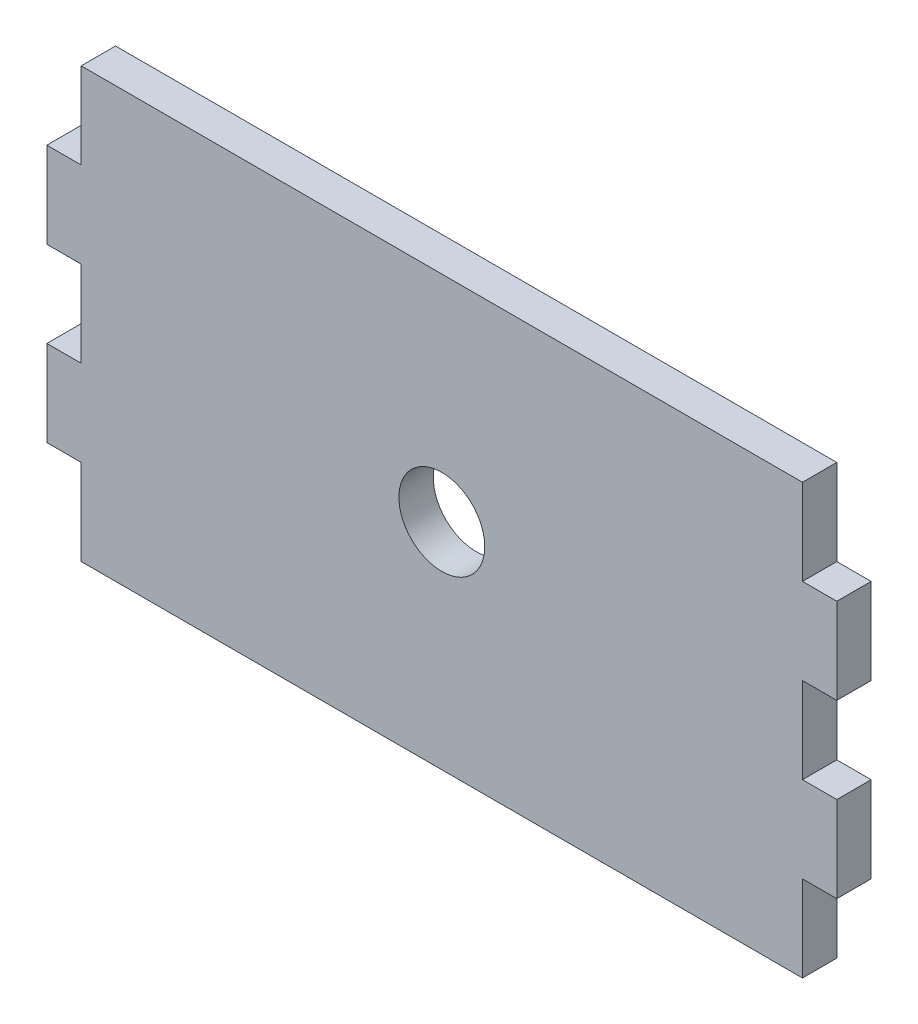
ISO-10303-21;
HEADER;
FILE_DESCRIPTION(('STEP AP214'),'2;1');
FILE_NAME('part.step','',(''),(''),'','','');
FILE_SCHEMA(('AUTOMOTIVE_DESIGN { 1 0 10303 214 1 1 1 1 }'));
ENDSEC;
DATA;
#1=APPLICATION_CONTEXT('core data for automotive mechanical design processes');
#2=APPLICATION_PROTOCOL_DEFINITION('international standard','automotive_design',2000,#1);
#3=PRODUCT_CONTEXT('',#1,'mechanical');
#4=PRODUCT('Part','Part','',(#3));
#5=PRODUCT_RELATED_PRODUCT_CATEGORY('part','',(#4));
#6=PRODUCT_DEFINITION_FORMATION('','',#4);
#7=PRODUCT_DEFINITION_CONTEXT('part definition',#1,'design');
#8=PRODUCT_DEFINITION('design','',#6,#7);
#9=PRODUCT_DEFINITION_SHAPE('','',#8);
#10=(LENGTH_UNIT() NAMED_UNIT(*) SI_UNIT(.MILLI.,.METRE.));
#11=(NAMED_UNIT(*) PLANE_ANGLE_UNIT() SI_UNIT($,.RADIAN.));
#12=(NAMED_UNIT(*) SI_UNIT($,.STERADIAN.) SOLID_ANGLE_UNIT());
#13=UNCERTAINTY_MEASURE_WITH_UNIT(LENGTH_MEASURE(1.E-05),#10,'distance_accuracy_value','');
#14=(GEOMETRIC_REPRESENTATION_CONTEXT(3) GLOBAL_UNCERTAINTY_ASSIGNED_CONTEXT((#13)) GLOBAL_UNIT_ASSIGNED_CONTEXT((#10,
#11,#12)) REPRESENTATION_CONTEXT('',''));
#15=CARTESIAN_POINT('',(0.,0.,0.));
#16=DIRECTION('',(0.,0.,1.));
#17=DIRECTION('',(1.,0.,0.));
#18=AXIS2_PLACEMENT_3D('',#15,#16,#17);
#19=CARTESIAN_POINT('',(0.,0.,4.));
#20=DIRECTION('',(0.,0.,1.));
#21=DIRECTION('',(1.,0.,0.));
#22=AXIS2_PLACEMENT_3D('',#19,#20,#21);
#23=PLANE('',#22);
#24=DIRECTION('',(0.,-1.,0.));
#25=VECTOR('',#24,1.);
#26=CARTESIAN_POINT('',(-42.,25.,4.));
#27=LINE('',#26,#25);
#28=CARTESIAN_POINT('',(-42.,25.,4.));
#29=VERTEX_POINT('',#28);
#30=CARTESIAN_POINT('',(-42.,15.,4.));
#31=VERTEX_POINT('',#30);
#32=EDGE_CURVE('E240',#29,#31,#27,.T.);
#33=ORIENTED_EDGE('',*,*,#32,.T.);
#34=DIRECTION('',(-1.,0.,0.));
#35=VECTOR('',#34,1.);
#36=CARTESIAN_POINT('',(-46.,15.,4.));
#37=LINE('',#36,#35);
#38=CARTESIAN_POINT('',(-46.,15.,4.));
#39=VERTEX_POINT('',#38);
#40=EDGE_CURVE('E128',#31,#39,#37,.T.);
#41=ORIENTED_EDGE('',*,*,#40,.T.);
#42=DIRECTION('',(0.,-1.,0.));
#43=VECTOR('',#42,1.);
#44=CARTESIAN_POINT('',(-46.,5.,4.));
#45=LINE('',#44,#43);
#46=CARTESIAN_POINT('',(-46.,5.,4.));
#47=VERTEX_POINT('',#46);
#48=EDGE_CURVE('E291',#39,#47,#45,.T.);
#49=ORIENTED_EDGE('',*,*,#48,.T.);
#50=DIRECTION('',(1.,0.,0.));
#51=VECTOR('',#50,1.);
#52=CARTESIAN_POINT('',(-46.,5.,4.));
#53=LINE('',#52,#51);
#54=CARTESIAN_POINT('',(-42.,5.,4.));
#55=VERTEX_POINT('',#54);
#56=EDGE_CURVE('E310',#47,#55,#53,.T.);
#57=ORIENTED_EDGE('',*,*,#56,.T.);
#58=DIRECTION('',(0.,-1.,0.));
#59=VECTOR('',#58,1.);
#60=CARTESIAN_POINT('',(-42.,5.,4.));
#61=LINE('',#60,#59);
#62=CARTESIAN_POINT('',(-42.,-5.,4.));
#63=VERTEX_POINT('',#62);
#64=EDGE_CURVE('E307',#55,#63,#61,.T.);
#65=ORIENTED_EDGE('',*,*,#64,.T.);
#66=DIRECTION('',(-1.,0.,0.));
#67=VECTOR('',#66,1.);
#68=CARTESIAN_POINT('',(-46.,-5.,4.));
#69=LINE('',#68,#67);
#70=CARTESIAN_POINT('',(-46.,-5.,4.));
#71=VERTEX_POINT('',#70);
#72=EDGE_CURVE('E309',#63,#71,#69,.T.);
#73=ORIENTED_EDGE('',*,*,#72,.T.);
#74=DIRECTION('',(0.,-1.,0.));
#75=VECTOR('',#74,1.);
#76=CARTESIAN_POINT('',(-46.,-15.,4.));
#77=LINE('',#76,#75);
#78=CARTESIAN_POINT('',(-46.,-15.,4.));
#79=VERTEX_POINT('',#78);
#80=EDGE_CURVE('E312',#71,#79,#77,.T.);
#81=ORIENTED_EDGE('',*,*,#80,.T.);
#82=DIRECTION('',(1.,0.,0.));
#83=VECTOR('',#82,1.);
#84=CARTESIAN_POINT('',(-46.,-15.,4.));
#85=LINE('',#84,#83);
#86=CARTESIAN_POINT('',(-42.,-15.,4.));
#87=VERTEX_POINT('',#86);
#88=EDGE_CURVE('E318',#79,#87,#85,.T.);
#89=ORIENTED_EDGE('',*,*,#88,.T.);
#90=DIRECTION('',(0.,-1.,0.));
#91=VECTOR('',#90,1.);
#92=CARTESIAN_POINT('',(-42.,-15.,4.));
#93=LINE('',#92,#91);
#94=CARTESIAN_POINT('',(-42.,-25.,4.));
#95=VERTEX_POINT('',#94);
#96=EDGE_CURVE('E320',#87,#95,#93,.T.);
#97=ORIENTED_EDGE('',*,*,#96,.T.);
#98=DIRECTION('',(1.,0.,0.));
#99=VECTOR('',#98,1.);
#100=CARTESIAN_POINT('',(-42.,-25.,4.));
#101=LINE('',#100,#99);
#102=CARTESIAN_POINT('',(42.,-25.,4.));
#103=VERTEX_POINT('',#102);
#104=EDGE_CURVE('E322',#95,#103,#101,.T.);
#105=ORIENTED_EDGE('',*,*,#104,.T.);
#106=DIRECTION('',(0.,1.,0.));
#107=VECTOR('',#106,1.);
#108=CARTESIAN_POINT('',(42.,-15.,4.));
#109=LINE('',#108,#107);
#110=CARTESIAN_POINT('',(42.,-15.,4.));
#111=VERTEX_POINT('',#110);
#112=EDGE_CURVE('E324',#103,#111,#109,.T.);
#113=ORIENTED_EDGE('',*,*,#112,.T.);
#114=DIRECTION('',(1.,0.,0.));
#115=VECTOR('',#114,1.);
#116=CARTESIAN_POINT('',(46.,-15.,4.));
#117=LINE('',#116,#115);
#118=CARTESIAN_POINT('',(46.,-15.,4.));
#119=VERTEX_POINT('',#118);
#120=EDGE_CURVE('E326',#111,#119,#117,.T.);
#121=ORIENTED_EDGE('',*,*,#120,.T.);
#122=DIRECTION('',(0.,1.,0.));
#123=VECTOR('',#122,1.);
#124=CARTESIAN_POINT('',(46.,-15.,4.));
#125=LINE('',#124,#123);
#126=CARTESIAN_POINT('',(46.,-5.00000000000001,4.));
#127=VERTEX_POINT('',#126);
#128=EDGE_CURVE('E328',#119,#127,#125,.T.);
#129=ORIENTED_EDGE('',*,*,#128,.T.);
#130=DIRECTION('',(-1.,0.,0.));
#131=VECTOR('',#130,1.);
#132=CARTESIAN_POINT('',(46.,-5.00000000000001,4.));
#133=LINE('',#132,#131);
#134=CARTESIAN_POINT('',(42.,-5.00000000000002,4.));
#135=VERTEX_POINT('',#134);
#136=EDGE_CURVE('E330',#127,#135,#133,.T.);
#137=ORIENTED_EDGE('',*,*,#136,.T.);
#138=DIRECTION('',(0.,1.,0.));
#139=VECTOR('',#138,1.);
#140=CARTESIAN_POINT('',(42.,5.00000000000002,4.));
#141=LINE('',#140,#139);
#142=CARTESIAN_POINT('',(42.,5.00000000000002,4.));
#143=VERTEX_POINT('',#142);
#144=EDGE_CURVE('E332',#135,#143,#141,.T.);
#145=ORIENTED_EDGE('',*,*,#144,.T.);
#146=DIRECTION('',(1.,0.,0.));
#147=VECTOR('',#146,1.);
#148=CARTESIAN_POINT('',(46.,5.00000000000001,4.));
#149=LINE('',#148,#147);
#150=CARTESIAN_POINT('',(46.,5.00000000000001,4.));
#151=VERTEX_POINT('',#150);
#152=EDGE_CURVE('E334',#143,#151,#149,.T.);
#153=ORIENTED_EDGE('',*,*,#152,.T.);
#154=DIRECTION('',(0.,1.,0.));
#155=VECTOR('',#154,1.);
#156=CARTESIAN_POINT('',(46.,5.00000000000001,4.));
#157=LINE('',#156,#155);
#158=CARTESIAN_POINT('',(46.,15.,4.));
#159=VERTEX_POINT('',#158);
#160=EDGE_CURVE('E183',#151,#159,#157,.T.);
#161=ORIENTED_EDGE('',*,*,#160,.T.);
#162=DIRECTION('',(-1.,0.,0.));
#163=VECTOR('',#162,1.);
#164=CARTESIAN_POINT('',(46.,15.,4.));
#165=LINE('',#164,#163);
#166=CARTESIAN_POINT('',(42.,15.,4.));
#167=VERTEX_POINT('',#166);
#168=EDGE_CURVE('E177',#159,#167,#165,.T.);
#169=ORIENTED_EDGE('',*,*,#168,.T.);
#170=DIRECTION('',(0.,1.,0.));
#171=VECTOR('',#170,1.);
#172=CARTESIAN_POINT('',(42.,25.,4.));
#173=LINE('',#172,#171);
#174=CARTESIAN_POINT('',(42.,25.,4.));
#175=VERTEX_POINT('',#174);
#176=EDGE_CURVE('E181',#167,#175,#173,.T.);
#177=ORIENTED_EDGE('',*,*,#176,.T.);
#178=DIRECTION('',(-1.,0.,0.));
#179=VECTOR('',#178,1.);
#180=CARTESIAN_POINT('',(-42.,25.,4.));
#181=LINE('',#180,#179);
#182=EDGE_CURVE('E49',#175,#29,#181,.T.);
#183=ORIENTED_EDGE('',*,*,#182,.T.);
#184=EDGE_LOOP('',(#33,#41,#49,#57,#65,#73,#81,#89,#97,#105,#113,#121,#129,#137,#145,#153,#161,
#169,#177,#183));
#185=FACE_BOUND('',#184,.T.);
#186=CARTESIAN_POINT('',(0.,0.,4.));
#187=DIRECTION('',(0.,0.,1.));
#188=DIRECTION('',(1.,0.,0.));
#189=AXIS2_PLACEMENT_3D('',#186,#187,#188);
#190=CIRCLE('',#189,5.);
#191=CARTESIAN_POINT('',(5.,0.,4.));
#192=VERTEX_POINT('',#191);
#193=EDGE_CURVE('E205',#192,#192,#190,.T.);
#194=ORIENTED_EDGE('',*,*,#193,.F.);
#195=EDGE_LOOP('',(#194));
#196=FACE_BOUND('',#195,.T.);
#197=ADVANCED_FACE('F32',(#185,#196),#23,.T.);
#198=CARTESIAN_POINT('',(0.,0.,0.));
#199=DIRECTION('',(0.,0.,1.));
#200=DIRECTION('',(1.,0.,0.));
#201=AXIS2_PLACEMENT_3D('',#198,#199,#200);
#202=PLANE('',#201);
#203=DIRECTION('',(0.,-1.,0.));
#204=VECTOR('',#203,1.);
#205=CARTESIAN_POINT('',(-42.,25.,0.));
#206=LINE('',#205,#204);
#207=CARTESIAN_POINT('',(-42.,25.,0.));
#208=VERTEX_POINT('',#207);
#209=CARTESIAN_POINT('',(-42.,15.,0.));
#210=VERTEX_POINT('',#209);
#211=EDGE_CURVE('E201',#208,#210,#206,.T.);
#212=ORIENTED_EDGE('',*,*,#211,.F.);
#213=DIRECTION('',(-1.,0.,0.));
#214=VECTOR('',#213,1.);
#215=CARTESIAN_POINT('',(-42.,25.,0.));
#216=LINE('',#215,#214);
#217=CARTESIAN_POINT('',(42.,25.,0.));
#218=VERTEX_POINT('',#217);
#219=EDGE_CURVE('E120',#218,#208,#216,.T.);
#220=ORIENTED_EDGE('',*,*,#219,.F.);
#221=DIRECTION('',(0.,1.,0.));
#222=VECTOR('',#221,1.);
#223=CARTESIAN_POINT('',(42.,25.,0.));
#224=LINE('',#223,#222);
#225=CARTESIAN_POINT('',(42.,15.,0.));
#226=VERTEX_POINT('',#225);
#227=EDGE_CURVE('E114',#226,#218,#224,.T.);
#228=ORIENTED_EDGE('',*,*,#227,.F.);
#229=DIRECTION('',(-1.,0.,0.));
#230=VECTOR('',#229,1.);
#231=CARTESIAN_POINT('',(46.,15.,0.));
#232=LINE('',#231,#230);
#233=CARTESIAN_POINT('',(46.,15.,0.));
#234=VERTEX_POINT('',#233);
#235=EDGE_CURVE('E191',#234,#226,#232,.T.);
#236=ORIENTED_EDGE('',*,*,#235,.F.);
#237=DIRECTION('',(0.,1.,0.));
#238=VECTOR('',#237,1.);
#239=CARTESIAN_POINT('',(46.,5.00000000000001,0.));
#240=LINE('',#239,#238);
#241=CARTESIAN_POINT('',(46.,5.00000000000001,0.));
#242=VERTEX_POINT('',#241);
#243=EDGE_CURVE('E235',#242,#234,#240,.T.);
#244=ORIENTED_EDGE('',*,*,#243,.F.);
#245=DIRECTION('',(1.,0.,0.));
#246=VECTOR('',#245,1.);
#247=CARTESIAN_POINT('',(46.,5.00000000000001,0.));
#248=LINE('',#247,#246);
#249=CARTESIAN_POINT('',(42.,5.00000000000002,0.));
#250=VERTEX_POINT('',#249);
#251=EDGE_CURVE('E233',#250,#242,#248,.T.);
#252=ORIENTED_EDGE('',*,*,#251,.F.);
#253=DIRECTION('',(0.,1.,0.));
#254=VECTOR('',#253,1.);
#255=CARTESIAN_POINT('',(42.,5.00000000000002,0.));
#256=LINE('',#255,#254);
#257=CARTESIAN_POINT('',(42.,-5.00000000000002,0.));
#258=VERTEX_POINT('',#257);
#259=EDGE_CURVE('E231',#258,#250,#256,.T.);
#260=ORIENTED_EDGE('',*,*,#259,.F.);
#261=DIRECTION('',(-1.,0.,0.));
#262=VECTOR('',#261,1.);
#263=CARTESIAN_POINT('',(46.,-5.00000000000001,0.));
#264=LINE('',#263,#262);
#265=CARTESIAN_POINT('',(46.,-5.00000000000001,0.));
#266=VERTEX_POINT('',#265);
#267=EDGE_CURVE('E229',#266,#258,#264,.T.);
#268=ORIENTED_EDGE('',*,*,#267,.F.);
#269=DIRECTION('',(0.,1.,0.));
#270=VECTOR('',#269,1.);
#271=CARTESIAN_POINT('',(46.,-15.,0.));
#272=LINE('',#271,#270);
#273=CARTESIAN_POINT('',(46.,-15.,0.));
#274=VERTEX_POINT('',#273);
#275=EDGE_CURVE('E227',#274,#266,#272,.T.);
#276=ORIENTED_EDGE('',*,*,#275,.F.);
#277=DIRECTION('',(1.,0.,0.));
#278=VECTOR('',#277,1.);
#279=CARTESIAN_POINT('',(46.,-15.,0.));
#280=LINE('',#279,#278);
#281=CARTESIAN_POINT('',(42.,-15.,0.));
#282=VERTEX_POINT('',#281);
#283=EDGE_CURVE('E225',#282,#274,#280,.T.);
#284=ORIENTED_EDGE('',*,*,#283,.F.);
#285=DIRECTION('',(0.,1.,0.));
#286=VECTOR('',#285,1.);
#287=CARTESIAN_POINT('',(42.,-15.,0.));
#288=LINE('',#287,#286);
#289=CARTESIAN_POINT('',(42.,-25.,0.));
#290=VERTEX_POINT('',#289);
#291=EDGE_CURVE('E223',#290,#282,#288,.T.);
#292=ORIENTED_EDGE('',*,*,#291,.F.);
#293=DIRECTION('',(1.,0.,0.));
#294=VECTOR('',#293,1.);
#295=CARTESIAN_POINT('',(-42.,-25.,0.));
#296=LINE('',#295,#294);
#297=CARTESIAN_POINT('',(-42.,-25.,0.));
#298=VERTEX_POINT('',#297);
#299=EDGE_CURVE('E221',#298,#290,#296,.T.);
#300=ORIENTED_EDGE('',*,*,#299,.F.);
#301=DIRECTION('',(0.,-1.,0.));
#302=VECTOR('',#301,1.);
#303=CARTESIAN_POINT('',(-42.,-15.,0.));
#304=LINE('',#303,#302);
#305=CARTESIAN_POINT('',(-42.,-15.,0.));
#306=VERTEX_POINT('',#305);
#307=EDGE_CURVE('E219',#306,#298,#304,.T.);
#308=ORIENTED_EDGE('',*,*,#307,.F.);
#309=DIRECTION('',(1.,0.,0.));
#310=VECTOR('',#309,1.);
#311=CARTESIAN_POINT('',(-46.,-15.,0.));
#312=LINE('',#311,#310);
#313=CARTESIAN_POINT('',(-46.,-15.,0.));
#314=VERTEX_POINT('',#313);
#315=EDGE_CURVE('E217',#314,#306,#312,.T.);
#316=ORIENTED_EDGE('',*,*,#315,.F.);
#317=DIRECTION('',(0.,-1.,0.));
#318=VECTOR('',#317,1.);
#319=CARTESIAN_POINT('',(-46.,-15.,0.));
#320=LINE('',#319,#318);
#321=CARTESIAN_POINT('',(-46.,-5.,0.));
#322=VERTEX_POINT('',#321);
#323=EDGE_CURVE('E215',#322,#314,#320,.T.);
#324=ORIENTED_EDGE('',*,*,#323,.F.);
#325=DIRECTION('',(-1.,0.,0.));
#326=VECTOR('',#325,1.);
#327=CARTESIAN_POINT('',(-46.,-5.,0.));
#328=LINE('',#327,#326);
#329=CARTESIAN_POINT('',(-42.,-5.,0.));
#330=VERTEX_POINT('',#329);
#331=EDGE_CURVE('E213',#330,#322,#328,.T.);
#332=ORIENTED_EDGE('',*,*,#331,.F.);
#333=DIRECTION('',(0.,-1.,0.));
#334=VECTOR('',#333,1.);
#335=CARTESIAN_POINT('',(-42.,5.,0.));
#336=LINE('',#335,#334);
#337=CARTESIAN_POINT('',(-42.,5.,0.));
#338=VERTEX_POINT('',#337);
#339=EDGE_CURVE('E211',#338,#330,#336,.T.);
#340=ORIENTED_EDGE('',*,*,#339,.F.);
#341=DIRECTION('',(1.,0.,0.));
#342=VECTOR('',#341,1.);
#343=CARTESIAN_POINT('',(-46.,5.,0.));
#344=LINE('',#343,#342);
#345=CARTESIAN_POINT('',(-46.,5.,0.));
#346=VERTEX_POINT('',#345);
#347=EDGE_CURVE('E209',#346,#338,#344,.T.);
#348=ORIENTED_EDGE('',*,*,#347,.F.);
#349=DIRECTION('',(0.,-1.,0.));
#350=VECTOR('',#349,1.);
#351=CARTESIAN_POINT('',(-46.,5.,0.));
#352=LINE('',#351,#350);
#353=CARTESIAN_POINT('',(-46.,15.,0.));
#354=VERTEX_POINT('',#353);
#355=EDGE_CURVE('E207',#354,#346,#352,.T.);
#356=ORIENTED_EDGE('',*,*,#355,.F.);
#357=DIRECTION('',(-1.,0.,0.));
#358=VECTOR('',#357,1.);
#359=CARTESIAN_POINT('',(-46.,15.,0.));
#360=LINE('',#359,#358);
#361=EDGE_CURVE('E204',#210,#354,#360,.T.);
#362=ORIENTED_EDGE('',*,*,#361,.F.);
#363=EDGE_LOOP('',(#212,#220,#228,#236,#244,#252,#260,#268,#276,#284,#292,#300,#308,#316,#324,
#332,#340,#348,#356,#362));
#364=FACE_BOUND('',#363,.T.);
#365=CARTESIAN_POINT('',(0.,0.,0.));
#366=DIRECTION('',(0.,0.,1.));
#367=DIRECTION('',(1.,0.,0.));
#368=AXIS2_PLACEMENT_3D('',#365,#366,#367);
#369=CIRCLE('',#368,5.);
#370=CARTESIAN_POINT('',(5.,0.,0.));
#371=VERTEX_POINT('',#370);
#372=EDGE_CURVE('E585',#371,#371,#369,.T.);
#373=ORIENTED_EDGE('',*,*,#372,.T.);
#374=EDGE_LOOP('',(#373));
#375=FACE_BOUND('',#374,.T.);
#376=ADVANCED_FACE('F295',(#364,#375),#202,.F.);
#377=CARTESIAN_POINT('',(-42.,25.,4.));
#378=DIRECTION('',(1.,0.,0.));
#379=DIRECTION('',(0.,1.,0.));
#380=AXIS2_PLACEMENT_3D('',#377,#378,#379);
#381=PLANE('',#380);
#382=ORIENTED_EDGE('',*,*,#211,.T.);
#383=DIRECTION('',(0.,0.,-1.));
#384=VECTOR('',#383,1.);
#385=CARTESIAN_POINT('',(-42.,15.,4.));
#386=LINE('',#385,#384);
#387=EDGE_CURVE('E11',#31,#210,#386,.T.);
#388=ORIENTED_EDGE('',*,*,#387,.F.);
#389=ORIENTED_EDGE('',*,*,#32,.F.);
#390=DIRECTION('',(0.,0.,-1.));
#391=VECTOR('',#390,1.);
#392=CARTESIAN_POINT('',(-42.,25.,4.));
#393=LINE('',#392,#391);
#394=EDGE_CURVE('E197',#29,#208,#393,.T.);
#395=ORIENTED_EDGE('',*,*,#394,.T.);
#396=EDGE_LOOP('',(#382,#388,#389,#395));
#397=FACE_BOUND('',#396,.T.);
#398=ADVANCED_FACE('F34',(#397),#381,.F.);
#399=CARTESIAN_POINT('',(-46.,15.,4.));
#400=DIRECTION('',(0.,-1.,0.));
#401=DIRECTION('',(1.,0.,0.));
#402=AXIS2_PLACEMENT_3D('',#399,#400,#401);
#403=PLANE('',#402);
#404=ORIENTED_EDGE('',*,*,#361,.T.);
#405=DIRECTION('',(0.,0.,-1.));
#406=VECTOR('',#405,1.);
#407=CARTESIAN_POINT('',(-46.,15.,4.));
#408=LINE('',#407,#406);
#409=EDGE_CURVE('E41',#39,#354,#408,.T.);
#410=ORIENTED_EDGE('',*,*,#409,.F.);
#411=ORIENTED_EDGE('',*,*,#40,.F.);
#412=ORIENTED_EDGE('',*,*,#387,.T.);
#413=EDGE_LOOP('',(#404,#410,#411,#412));
#414=FACE_BOUND('',#413,.T.);
#415=ADVANCED_FACE('F368',(#414),#403,.F.);
#416=CARTESIAN_POINT('',(-46.,5.,4.));
#417=DIRECTION('',(1.,0.,0.));
#418=DIRECTION('',(0.,0.,-1.));
#419=AXIS2_PLACEMENT_3D('',#416,#417,#418);
#420=PLANE('',#419);
#421=ORIENTED_EDGE('',*,*,#355,.T.);
#422=DIRECTION('',(0.,0.,-1.));
#423=VECTOR('',#422,1.);
#424=CARTESIAN_POINT('',(-46.,5.,4.));
#425=LINE('',#424,#423);
#426=EDGE_CURVE('E283',#47,#346,#425,.T.);
#427=ORIENTED_EDGE('',*,*,#426,.F.);
#428=ORIENTED_EDGE('',*,*,#48,.F.);
#429=ORIENTED_EDGE('',*,*,#409,.T.);
#430=EDGE_LOOP('',(#421,#427,#428,#429));
#431=FACE_BOUND('',#430,.T.);
#432=ADVANCED_FACE('F289',(#431),#420,.F.);
#433=CARTESIAN_POINT('',(-46.,5.,4.));
#434=DIRECTION('',(0.,1.,0.));
#435=DIRECTION('',(-1.,0.,0.));
#436=AXIS2_PLACEMENT_3D('',#433,#434,#435);
#437=PLANE('',#436);
#438=ORIENTED_EDGE('',*,*,#347,.T.);
#439=DIRECTION('',(0.,0.,-1.));
#440=VECTOR('',#439,1.);
#441=CARTESIAN_POINT('',(-42.,5.,4.));
#442=LINE('',#441,#440);
#443=EDGE_CURVE('E280',#55,#338,#442,.T.);
#444=ORIENTED_EDGE('',*,*,#443,.F.);
#445=ORIENTED_EDGE('',*,*,#56,.F.);
#446=ORIENTED_EDGE('',*,*,#426,.T.);
#447=EDGE_LOOP('',(#438,#444,#445,#446));
#448=FACE_BOUND('',#447,.T.);
#449=ADVANCED_FACE('F301',(#448),#437,.F.);
#450=CARTESIAN_POINT('',(-42.,5.,4.));
#451=DIRECTION('',(1.,0.,0.));
#452=DIRECTION('',(0.,0.,-1.));
#453=AXIS2_PLACEMENT_3D('',#450,#451,#452);
#454=PLANE('',#453);
#455=ORIENTED_EDGE('',*,*,#339,.T.);
#456=DIRECTION('',(0.,0.,-1.));
#457=VECTOR('',#456,1.);
#458=CARTESIAN_POINT('',(-42.,-5.,4.));
#459=LINE('',#458,#457);
#460=EDGE_CURVE('E277',#63,#330,#459,.T.);
#461=ORIENTED_EDGE('',*,*,#460,.F.);
#462=ORIENTED_EDGE('',*,*,#64,.F.);
#463=ORIENTED_EDGE('',*,*,#443,.T.);
#464=EDGE_LOOP('',(#455,#461,#462,#463));
#465=FACE_BOUND('',#464,.T.);
#466=ADVANCED_FACE('F305',(#465),#454,.F.);
#467=CARTESIAN_POINT('',(-46.,-5.,4.));
#468=DIRECTION('',(0.,-1.,0.));
#469=DIRECTION('',(0.,0.,-1.));
#470=AXIS2_PLACEMENT_3D('',#467,#468,#469);
#471=PLANE('',#470);
#472=ORIENTED_EDGE('',*,*,#331,.T.);
#473=DIRECTION('',(0.,0.,-1.));
#474=VECTOR('',#473,1.);
#475=CARTESIAN_POINT('',(-46.,-5.,4.));
#476=LINE('',#475,#474);
#477=EDGE_CURVE('E274',#71,#322,#476,.T.);
#478=ORIENTED_EDGE('',*,*,#477,.F.);
#479=ORIENTED_EDGE('',*,*,#72,.F.);
#480=ORIENTED_EDGE('',*,*,#460,.T.);
#481=EDGE_LOOP('',(#472,#478,#479,#480));
#482=FACE_BOUND('',#481,.T.);
#483=ADVANCED_FACE('F381',(#482),#471,.F.);
#484=CARTESIAN_POINT('',(-46.,-15.,4.));
#485=DIRECTION('',(1.,0.,0.));
#486=DIRECTION('',(0.,1.,0.));
#487=AXIS2_PLACEMENT_3D('',#484,#485,#486);
#488=PLANE('',#487);
#489=ORIENTED_EDGE('',*,*,#323,.T.);
#490=DIRECTION('',(0.,0.,-1.));
#491=VECTOR('',#490,1.);
#492=CARTESIAN_POINT('',(-46.,-15.,4.));
#493=LINE('',#492,#491);
#494=EDGE_CURVE('E271',#79,#314,#493,.T.);
#495=ORIENTED_EDGE('',*,*,#494,.F.);
#496=ORIENTED_EDGE('',*,*,#80,.F.);
#497=ORIENTED_EDGE('',*,*,#477,.T.);
#498=EDGE_LOOP('',(#489,#495,#496,#497));
#499=FACE_BOUND('',#498,.T.);
#500=ADVANCED_FACE('F384',(#499),#488,.F.);
#501=CARTESIAN_POINT('',(-46.,-15.,4.));
#502=DIRECTION('',(0.,1.,0.));
#503=DIRECTION('',(0.,0.,1.));
#504=AXIS2_PLACEMENT_3D('',#501,#502,#503);
#505=PLANE('',#504);
#506=ORIENTED_EDGE('',*,*,#315,.T.);
#507=DIRECTION('',(0.,0.,-1.));
#508=VECTOR('',#507,1.);
#509=CARTESIAN_POINT('',(-42.,-15.,4.));
#510=LINE('',#509,#508);
#511=EDGE_CURVE('E268',#87,#306,#510,.T.);
#512=ORIENTED_EDGE('',*,*,#511,.F.);
#513=ORIENTED_EDGE('',*,*,#88,.F.);
#514=ORIENTED_EDGE('',*,*,#494,.T.);
#515=EDGE_LOOP('',(#506,#512,#513,#514));
#516=FACE_BOUND('',#515,.T.);
#517=ADVANCED_FACE('F388',(#516),#505,.F.);
#518=CARTESIAN_POINT('',(-42.,-15.,4.));
#519=DIRECTION('',(1.,0.,0.));
#520=DIRECTION('',(0.,0.,-1.));
#521=AXIS2_PLACEMENT_3D('',#518,#519,#520);
#522=PLANE('',#521);
#523=ORIENTED_EDGE('',*,*,#307,.T.);
#524=DIRECTION('',(0.,0.,-1.));
#525=VECTOR('',#524,1.);
#526=CARTESIAN_POINT('',(-42.,-25.,4.));
#527=LINE('',#526,#525);
#528=EDGE_CURVE('E265',#95,#298,#527,.T.);
#529=ORIENTED_EDGE('',*,*,#528,.F.);
#530=ORIENTED_EDGE('',*,*,#96,.F.);
#531=ORIENTED_EDGE('',*,*,#511,.T.);
#532=EDGE_LOOP('',(#523,#529,#530,#531));
#533=FACE_BOUND('',#532,.T.);
#534=ADVANCED_FACE('F392',(#533),#522,.F.);
#535=CARTESIAN_POINT('',(-42.,-25.,4.));
#536=DIRECTION('',(0.,1.,0.));
#537=DIRECTION('',(-1.,0.,0.));
#538=AXIS2_PLACEMENT_3D('',#535,#536,#537);
#539=PLANE('',#538);
#540=ORIENTED_EDGE('',*,*,#299,.T.);
#541=DIRECTION('',(0.,0.,-1.));
#542=VECTOR('',#541,1.);
#543=CARTESIAN_POINT('',(42.,-25.,4.));
#544=LINE('',#543,#542);
#545=EDGE_CURVE('E262',#103,#290,#544,.T.);
#546=ORIENTED_EDGE('',*,*,#545,.F.);
#547=ORIENTED_EDGE('',*,*,#104,.F.);
#548=ORIENTED_EDGE('',*,*,#528,.T.);
#549=EDGE_LOOP('',(#540,#546,#547,#548));
#550=FACE_BOUND('',#549,.T.);
#551=ADVANCED_FACE('F396',(#550),#539,.F.);
#552=CARTESIAN_POINT('',(42.,-15.,4.));
#553=DIRECTION('',(-1.,0.,0.));
#554=DIRECTION('',(0.,-1.,0.));
#555=AXIS2_PLACEMENT_3D('',#552,#553,#554);
#556=PLANE('',#555);
#557=ORIENTED_EDGE('',*,*,#291,.T.);
#558=DIRECTION('',(0.,0.,-1.));
#559=VECTOR('',#558,1.);
#560=CARTESIAN_POINT('',(42.,-15.,4.));
#561=LINE('',#560,#559);
#562=EDGE_CURVE('E259',#111,#282,#561,.T.);
#563=ORIENTED_EDGE('',*,*,#562,.F.);
#564=ORIENTED_EDGE('',*,*,#112,.F.);
#565=ORIENTED_EDGE('',*,*,#545,.T.);
#566=EDGE_LOOP('',(#557,#563,#564,#565));
#567=FACE_BOUND('',#566,.T.);
#568=ADVANCED_FACE('F400',(#567),#556,.F.);
#569=CARTESIAN_POINT('',(46.,-15.,4.));
#570=DIRECTION('',(0.,1.,0.));
#571=DIRECTION('',(0.,0.,1.));
#572=AXIS2_PLACEMENT_3D('',#569,#570,#571);
#573=PLANE('',#572);
#574=ORIENTED_EDGE('',*,*,#283,.T.);
#575=DIRECTION('',(0.,0.,-1.));
#576=VECTOR('',#575,1.);
#577=CARTESIAN_POINT('',(46.,-15.,4.));
#578=LINE('',#577,#576);
#579=EDGE_CURVE('E256',#119,#274,#578,.T.);
#580=ORIENTED_EDGE('',*,*,#579,.F.);
#581=ORIENTED_EDGE('',*,*,#120,.F.);
#582=ORIENTED_EDGE('',*,*,#562,.T.);
#583=EDGE_LOOP('',(#574,#580,#581,#582));
#584=FACE_BOUND('',#583,.T.);
#585=ADVANCED_FACE('F404',(#584),#573,.F.);
#586=CARTESIAN_POINT('',(46.,-15.,4.));
#587=DIRECTION('',(-1.,0.,0.));
#588=DIRECTION('',(0.,-1.,0.));
#589=AXIS2_PLACEMENT_3D('',#586,#587,#588);
#590=PLANE('',#589);
#591=ORIENTED_EDGE('',*,*,#275,.T.);
#592=DIRECTION('',(0.,0.,-1.));
#593=VECTOR('',#592,1.);
#594=CARTESIAN_POINT('',(46.,-5.00000000000001,4.));
#595=LINE('',#594,#593);
#596=EDGE_CURVE('E253',#127,#266,#595,.T.);
#597=ORIENTED_EDGE('',*,*,#596,.F.);
#598=ORIENTED_EDGE('',*,*,#128,.F.);
#599=ORIENTED_EDGE('',*,*,#579,.T.);
#600=EDGE_LOOP('',(#591,#597,#598,#599));
#601=FACE_BOUND('',#600,.T.);
#602=ADVANCED_FACE('F408',(#601),#590,.F.);
#603=CARTESIAN_POINT('',(46.,-5.00000000000001,4.));
#604=DIRECTION('',(0.,-1.,0.));
#605=DIRECTION('',(1.,0.,0.));
#606=AXIS2_PLACEMENT_3D('',#603,#604,#605);
#607=PLANE('',#606);
#608=ORIENTED_EDGE('',*,*,#267,.T.);
#609=DIRECTION('',(0.,0.,-1.));
#610=VECTOR('',#609,1.);
#611=CARTESIAN_POINT('',(42.,-5.00000000000002,4.));
#612=LINE('',#611,#610);
#613=EDGE_CURVE('E250',#135,#258,#612,.T.);
#614=ORIENTED_EDGE('',*,*,#613,.F.);
#615=ORIENTED_EDGE('',*,*,#136,.F.);
#616=ORIENTED_EDGE('',*,*,#596,.T.);
#617=EDGE_LOOP('',(#608,#614,#615,#616));
#618=FACE_BOUND('',#617,.T.);
#619=ADVANCED_FACE('F412',(#618),#607,.F.);
#620=CARTESIAN_POINT('',(42.,5.00000000000002,4.));
#621=DIRECTION('',(-1.,0.,0.));
#622=DIRECTION('',(0.,0.,1.));
#623=AXIS2_PLACEMENT_3D('',#620,#621,#622);
#624=PLANE('',#623);
#625=ORIENTED_EDGE('',*,*,#259,.T.);
#626=DIRECTION('',(0.,0.,-1.));
#627=VECTOR('',#626,1.);
#628=CARTESIAN_POINT('',(42.,5.00000000000002,4.));
#629=LINE('',#628,#627);
#630=EDGE_CURVE('E247',#143,#250,#629,.T.);
#631=ORIENTED_EDGE('',*,*,#630,.F.);
#632=ORIENTED_EDGE('',*,*,#144,.F.);
#633=ORIENTED_EDGE('',*,*,#613,.T.);
#634=EDGE_LOOP('',(#625,#631,#632,#633));
#635=FACE_BOUND('',#634,.T.);
#636=ADVANCED_FACE('F416',(#635),#624,.F.);
#637=CARTESIAN_POINT('',(46.,5.00000000000001,4.));
#638=DIRECTION('',(0.,1.,0.));
#639=DIRECTION('',(-1.,0.,0.));
#640=AXIS2_PLACEMENT_3D('',#637,#638,#639);
#641=PLANE('',#640);
#642=ORIENTED_EDGE('',*,*,#251,.T.);
#643=DIRECTION('',(0.,0.,-1.));
#644=VECTOR('',#643,1.);
#645=CARTESIAN_POINT('',(46.,5.00000000000001,4.));
#646=LINE('',#645,#644);
#647=EDGE_CURVE('E244',#151,#242,#646,.T.);
#648=ORIENTED_EDGE('',*,*,#647,.F.);
#649=ORIENTED_EDGE('',*,*,#152,.F.);
#650=ORIENTED_EDGE('',*,*,#630,.T.);
#651=EDGE_LOOP('',(#642,#648,#649,#650));
#652=FACE_BOUND('',#651,.T.);
#653=ADVANCED_FACE('F340',(#652),#641,.F.);
#654=CARTESIAN_POINT('',(46.,5.00000000000001,4.));
#655=DIRECTION('',(-1.,0.,0.));
#656=DIRECTION('',(0.,-1.,0.));
#657=AXIS2_PLACEMENT_3D('',#654,#655,#656);
#658=PLANE('',#657);
#659=ORIENTED_EDGE('',*,*,#243,.T.);
#660=DIRECTION('',(0.,0.,-1.));
#661=VECTOR('',#660,1.);
#662=CARTESIAN_POINT('',(46.,15.,4.));
#663=LINE('',#662,#661);
#664=EDGE_CURVE('E192',#159,#234,#663,.T.);
#665=ORIENTED_EDGE('',*,*,#664,.F.);
#666=ORIENTED_EDGE('',*,*,#160,.F.);
#667=ORIENTED_EDGE('',*,*,#647,.T.);
#668=EDGE_LOOP('',(#659,#665,#666,#667));
#669=FACE_BOUND('',#668,.T.);
#670=ADVANCED_FACE('F344',(#669),#658,.F.);
#671=CARTESIAN_POINT('',(46.,15.,4.));
#672=DIRECTION('',(0.,-1.,0.));
#673=DIRECTION('',(0.,0.,-1.));
#674=AXIS2_PLACEMENT_3D('',#671,#672,#673);
#675=PLANE('',#674);
#676=ORIENTED_EDGE('',*,*,#235,.T.);
#677=DIRECTION('',(0.,0.,-1.));
#678=VECTOR('',#677,1.);
#679=CARTESIAN_POINT('',(42.,15.,4.));
#680=LINE('',#679,#678);
#681=EDGE_CURVE('E188',#167,#226,#680,.T.);
#682=ORIENTED_EDGE('',*,*,#681,.F.);
#683=ORIENTED_EDGE('',*,*,#168,.F.);
#684=ORIENTED_EDGE('',*,*,#664,.T.);
#685=EDGE_LOOP('',(#676,#682,#683,#684));
#686=FACE_BOUND('',#685,.T.);
#687=ADVANCED_FACE('F189',(#686),#675,.F.);
#688=CARTESIAN_POINT('',(42.,25.,4.));
#689=DIRECTION('',(-1.,0.,0.));
#690=DIRECTION('',(0.,-1.,0.));
#691=AXIS2_PLACEMENT_3D('',#688,#689,#690);
#692=PLANE('',#691);
#693=ORIENTED_EDGE('',*,*,#227,.T.);
#694=DIRECTION('',(0.,0.,-1.));
#695=VECTOR('',#694,1.);
#696=CARTESIAN_POINT('',(42.,25.,4.));
#697=LINE('',#696,#695);
#698=EDGE_CURVE('E193',#175,#218,#697,.T.);
#699=ORIENTED_EDGE('',*,*,#698,.F.);
#700=ORIENTED_EDGE('',*,*,#176,.F.);
#701=ORIENTED_EDGE('',*,*,#681,.T.);
#702=EDGE_LOOP('',(#693,#699,#700,#701));
#703=FACE_BOUND('',#702,.T.);
#704=ADVANCED_FACE('F195',(#703),#692,.F.);
#705=CARTESIAN_POINT('',(-42.,25.,4.));
#706=DIRECTION('',(0.,-1.,0.));
#707=DIRECTION('',(1.,0.,0.));
#708=AXIS2_PLACEMENT_3D('',#705,#706,#707);
#709=PLANE('',#708);
#710=ORIENTED_EDGE('',*,*,#219,.T.);
#711=ORIENTED_EDGE('',*,*,#394,.F.);
#712=ORIENTED_EDGE('',*,*,#182,.F.);
#713=ORIENTED_EDGE('',*,*,#698,.T.);
#714=EDGE_LOOP('',(#710,#711,#712,#713));
#715=FACE_BOUND('',#714,.T.);
#716=ADVANCED_FACE('F348',(#715),#709,.F.);
#717=CARTESIAN_POINT('',(0.,0.,4.));
#718=DIRECTION('',(0.,0.,-1.));
#719=DIRECTION('',(-1.,0.,0.));
#720=AXIS2_PLACEMENT_3D('',#717,#718,#719);
#721=CYLINDRICAL_SURFACE('',#720,5.);
#722=ORIENTED_EDGE('',*,*,#193,.T.);
#723=EDGE_LOOP('',(#722));
#724=FACE_BOUND('',#723,.T.);
#725=ORIENTED_EDGE('',*,*,#372,.F.);
#726=EDGE_LOOP('',(#725));
#727=FACE_BOUND('',#726,.T.);
#728=ADVANCED_FACE('F350',(#724,#727),#721,.F.);
#729=CLOSED_SHELL('',(#197,#376,#398,#415,#432,#449,#466,#483,#500,#517,#534,#551,#568,#585,
#602,#619,#636,#653,#670,#687,#704,#716,#728));
#730=MANIFOLD_SOLID_BREP('B2',#729);
#731=ADVANCED_BREP_SHAPE_REPRESENTATION('',(#18,#730),#14);
#732=SHAPE_DEFINITION_REPRESENTATION(#9,#731);
ENDSEC;
END-ISO-10303-21;
